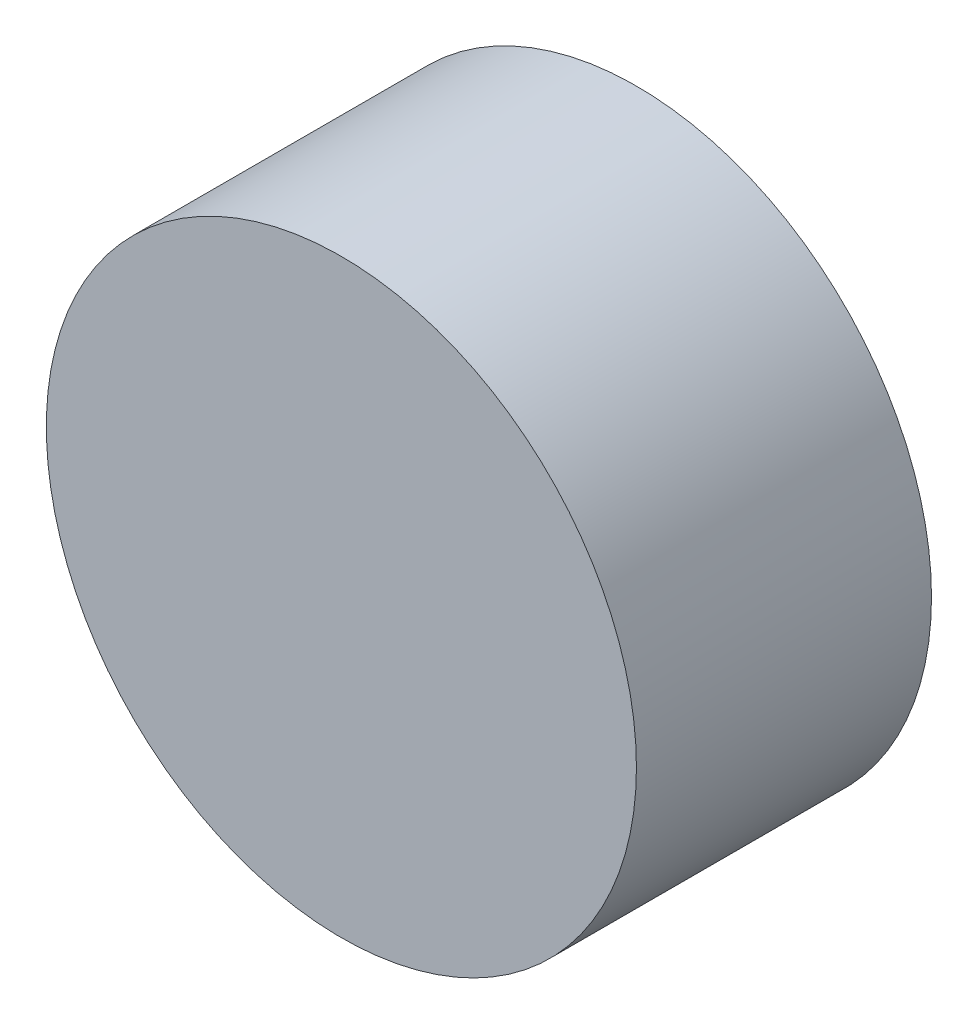
ISO-10303-21;
HEADER;
FILE_DESCRIPTION(('STEP AP214'),'2;1');
FILE_NAME('part.step','',(''),(''),'','','');
FILE_SCHEMA(('AUTOMOTIVE_DESIGN { 1 0 10303 214 1 1 1 1 }'));
ENDSEC;
DATA;
#1=APPLICATION_CONTEXT('core data for automotive mechanical design processes');
#2=APPLICATION_PROTOCOL_DEFINITION('international standard','automotive_design',2000,#1);
#3=PRODUCT_CONTEXT('',#1,'mechanical');
#4=PRODUCT('Part','Part','',(#3));
#5=PRODUCT_RELATED_PRODUCT_CATEGORY('part','',(#4));
#6=PRODUCT_DEFINITION_FORMATION('','',#4);
#7=PRODUCT_DEFINITION_CONTEXT('part definition',#1,'design');
#8=PRODUCT_DEFINITION('design','',#6,#7);
#9=PRODUCT_DEFINITION_SHAPE('','',#8);
#10=(LENGTH_UNIT() NAMED_UNIT(*) SI_UNIT(.MILLI.,.METRE.));
#11=(NAMED_UNIT(*) PLANE_ANGLE_UNIT() SI_UNIT($,.RADIAN.));
#12=(NAMED_UNIT(*) SI_UNIT($,.STERADIAN.) SOLID_ANGLE_UNIT());
#13=UNCERTAINTY_MEASURE_WITH_UNIT(LENGTH_MEASURE(1.E-05),#10,'distance_accuracy_value','');
#14=(GEOMETRIC_REPRESENTATION_CONTEXT(3) GLOBAL_UNCERTAINTY_ASSIGNED_CONTEXT((#13)) GLOBAL_UNIT_ASSIGNED_CONTEXT((#10,
#11,#12)) REPRESENTATION_CONTEXT('',''));
#15=CARTESIAN_POINT('',(0.,0.,0.));
#16=DIRECTION('',(0.,0.,1.));
#17=DIRECTION('',(1.,0.,0.));
#18=AXIS2_PLACEMENT_3D('',#15,#16,#17);
#19=CARTESIAN_POINT('',(0.,0.,10.));
#20=DIRECTION('',(0.,0.,-1.));
#21=DIRECTION('',(-1.,0.,0.));
#22=AXIS2_PLACEMENT_3D('',#19,#20,#21);
#23=CYLINDRICAL_SURFACE('',#22,10.);
#24=CARTESIAN_POINT('',(0.,0.,10.));
#25=DIRECTION('',(0.,0.,1.));
#26=DIRECTION('',(1.,0.,0.));
#27=AXIS2_PLACEMENT_3D('',#24,#25,#26);
#28=CIRCLE('',#27,10.);
#29=CARTESIAN_POINT('',(10.,0.,10.));
#30=VERTEX_POINT('',#29);
#31=EDGE_CURVE('E10',#30,#30,#28,.T.);
#32=ORIENTED_EDGE('',*,*,#31,.F.);
#33=EDGE_LOOP('',(#32));
#34=FACE_BOUND('',#33,.T.);
#35=CARTESIAN_POINT('',(0.,0.,0.));
#36=DIRECTION('',(0.,0.,1.));
#37=DIRECTION('',(1.,0.,0.));
#38=AXIS2_PLACEMENT_3D('',#35,#36,#37);
#39=CIRCLE('',#38,10.);
#40=CARTESIAN_POINT('',(10.,0.,0.));
#41=VERTEX_POINT('',#40);
#42=EDGE_CURVE('E40',#41,#41,#39,.T.);
#43=ORIENTED_EDGE('',*,*,#42,.T.);
#44=EDGE_LOOP('',(#43));
#45=FACE_BOUND('',#44,.T.);
#46=ADVANCED_FACE('F37',(#34,#45),#23,.T.);
#47=CARTESIAN_POINT('',(0.,0.,10.));
#48=DIRECTION('',(0.,0.,1.));
#49=DIRECTION('',(1.,0.,0.));
#50=AXIS2_PLACEMENT_3D('',#47,#48,#49);
#51=PLANE('',#50);
#52=ORIENTED_EDGE('',*,*,#31,.T.);
#53=EDGE_LOOP('',(#52));
#54=FACE_BOUND('',#53,.T.);
#55=ADVANCED_FACE('F54',(#54),#51,.T.);
#56=CARTESIAN_POINT('',(0.,0.,0.));
#57=DIRECTION('',(0.,0.,1.));
#58=DIRECTION('',(1.,0.,0.));
#59=AXIS2_PLACEMENT_3D('',#56,#57,#58);
#60=PLANE('',#59);
#61=ORIENTED_EDGE('',*,*,#42,.F.);
#62=EDGE_LOOP('',(#61));
#63=FACE_BOUND('',#62,.T.);
#64=ADVANCED_FACE('F52',(#63),#60,.F.);
#65=CLOSED_SHELL('',(#46,#55,#64));
#66=MANIFOLD_SOLID_BREP('B2',#65);
#67=ADVANCED_BREP_SHAPE_REPRESENTATION('',(#18,#66),#14);
#68=SHAPE_DEFINITION_REPRESENTATION(#9,#67);
ENDSEC;
END-ISO-10303-21;
